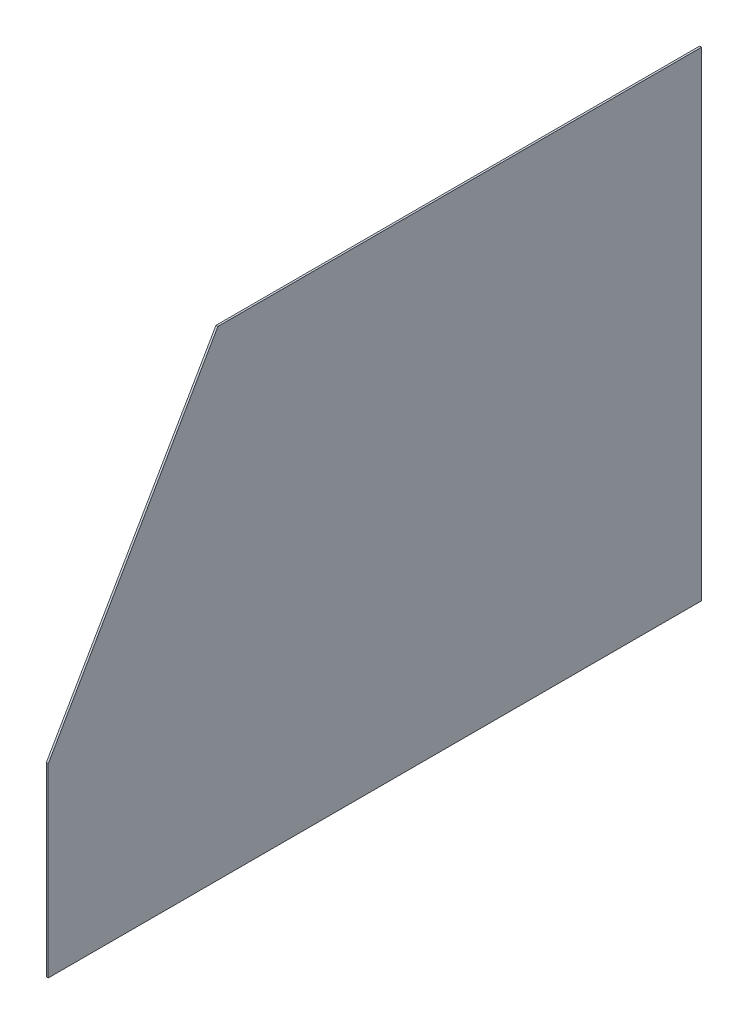
ISO-10303-21;
HEADER;
FILE_DESCRIPTION(('STEP AP214'),'2;1');
FILE_NAME('part.step','',(''),(''),'','','');
FILE_SCHEMA(('AUTOMOTIVE_DESIGN { 1 0 10303 214 1 1 1 1 }'));
ENDSEC;
DATA;
#1=APPLICATION_CONTEXT('core data for automotive mechanical design processes');
#2=APPLICATION_PROTOCOL_DEFINITION('international standard','automotive_design',2000,#1);
#3=PRODUCT_CONTEXT('',#1,'mechanical');
#4=PRODUCT('Part','Part','',(#3));
#5=PRODUCT_RELATED_PRODUCT_CATEGORY('part','',(#4));
#6=PRODUCT_DEFINITION_FORMATION('','',#4);
#7=PRODUCT_DEFINITION_CONTEXT('part definition',#1,'design');
#8=PRODUCT_DEFINITION('design','',#6,#7);
#9=PRODUCT_DEFINITION_SHAPE('','',#8);
#10=(LENGTH_UNIT() NAMED_UNIT(*) SI_UNIT(.MILLI.,.METRE.));
#11=(NAMED_UNIT(*) PLANE_ANGLE_UNIT() SI_UNIT($,.RADIAN.));
#12=(NAMED_UNIT(*) SI_UNIT($,.STERADIAN.) SOLID_ANGLE_UNIT());
#13=UNCERTAINTY_MEASURE_WITH_UNIT(LENGTH_MEASURE(1.E-05),#10,'distance_accuracy_value','');
#14=(GEOMETRIC_REPRESENTATION_CONTEXT(3) GLOBAL_UNCERTAINTY_ASSIGNED_CONTEXT((#13)) GLOBAL_UNIT_ASSIGNED_CONTEXT((#10,
#11,#12)) REPRESENTATION_CONTEXT('',''));
#15=CARTESIAN_POINT('',(0.,0.,0.));
#16=DIRECTION('',(0.,0.,1.));
#17=DIRECTION('',(1.,0.,0.));
#18=AXIS2_PLACEMENT_3D('',#15,#16,#17);
#19=CARTESIAN_POINT('',(3.175,-787.4,0.));
#20=DIRECTION('',(0.,0.,1.));
#21=DIRECTION('',(1.,0.,0.));
#22=AXIS2_PLACEMENT_3D('',#19,#20,#21);
#23=PLANE('',#22);
#24=DIRECTION('',(0.,1.,0.));
#25=VECTOR('',#24,1.);
#26=CARTESIAN_POINT('',(0.,-787.4,0.));
#27=LINE('',#26,#25);
#28=CARTESIAN_POINT('',(0.,-787.4,0.));
#29=VERTEX_POINT('',#28);
#30=CARTESIAN_POINT('',(0.,0.,0.));
#31=VERTEX_POINT('',#30);
#32=EDGE_CURVE('E106',#29,#31,#27,.T.);
#33=ORIENTED_EDGE('',*,*,#32,.T.);
#34=DIRECTION('',(-1.,0.,0.));
#35=VECTOR('',#34,1.);
#36=CARTESIAN_POINT('',(3.175,0.,0.));
#37=LINE('',#36,#35);
#38=CARTESIAN_POINT('',(3.175,0.,0.));
#39=VERTEX_POINT('',#38);
#40=EDGE_CURVE('E11',#39,#31,#37,.T.);
#41=ORIENTED_EDGE('',*,*,#40,.F.);
#42=DIRECTION('',(0.,1.,0.));
#43=VECTOR('',#42,1.);
#44=CARTESIAN_POINT('',(3.175,-787.4,0.));
#45=LINE('',#44,#43);
#46=CARTESIAN_POINT('',(3.175,-787.4,0.));
#47=VERTEX_POINT('',#46);
#48=EDGE_CURVE('E114',#47,#39,#45,.T.);
#49=ORIENTED_EDGE('',*,*,#48,.F.);
#50=DIRECTION('',(-1.,0.,0.));
#51=VECTOR('',#50,1.);
#52=CARTESIAN_POINT('',(3.175,-787.4,0.));
#53=LINE('',#52,#51);
#54=EDGE_CURVE('E102',#47,#29,#53,.T.);
#55=ORIENTED_EDGE('',*,*,#54,.T.);
#56=EDGE_LOOP('',(#33,#41,#49,#55));
#57=FACE_BOUND('',#56,.T.);
#58=ADVANCED_FACE('F32',(#57),#23,.F.);
#59=CARTESIAN_POINT('',(3.175,0.,0.));
#60=DIRECTION('',(0.,-1.,0.));
#61=DIRECTION('',(0.,0.,-1.));
#62=AXIS2_PLACEMENT_3D('',#59,#60,#61);
#63=PLANE('',#62);
#64=DIRECTION('',(0.,0.,1.));
#65=VECTOR('',#64,1.);
#66=CARTESIAN_POINT('',(0.,0.,0.));
#67=LINE('',#66,#65);
#68=CARTESIAN_POINT('',(0.,0.,794.520760089086));
#69=VERTEX_POINT('',#68);
#70=EDGE_CURVE('E109',#31,#69,#67,.T.);
#71=ORIENTED_EDGE('',*,*,#70,.T.);
#72=DIRECTION('',(-1.,0.,0.));
#73=VECTOR('',#72,1.);
#74=CARTESIAN_POINT('',(3.175,0.,794.520760089086));
#75=LINE('',#74,#73);
#76=CARTESIAN_POINT('',(3.175,0.,794.520760089086));
#77=VERTEX_POINT('',#76);
#78=EDGE_CURVE('E40',#77,#69,#75,.T.);
#79=ORIENTED_EDGE('',*,*,#78,.F.);
#80=DIRECTION('',(0.,0.,1.));
#81=VECTOR('',#80,1.);
#82=CARTESIAN_POINT('',(3.175,0.,0.));
#83=LINE('',#82,#81);
#84=EDGE_CURVE('E82',#39,#77,#83,.T.);
#85=ORIENTED_EDGE('',*,*,#84,.F.);
#86=ORIENTED_EDGE('',*,*,#40,.T.);
#87=EDGE_LOOP('',(#71,#79,#85,#86));
#88=FACE_BOUND('',#87,.T.);
#89=ADVANCED_FACE('F133',(#88),#63,.F.);
#90=CARTESIAN_POINT('',(3.175,0.,794.520760089086));
#91=DIRECTION('',(0.,-0.500000000000001,-0.866025403784438));
#92=DIRECTION('',(0.,0.866025403784438,-0.500000000000001));
#93=AXIS2_PLACEMENT_3D('',#90,#91,#92);
#94=PLANE('',#93);
#95=DIRECTION('',(0.,-0.866025403784438,0.500000000000001));
#96=VECTOR('',#95,1.);
#97=CARTESIAN_POINT('',(0.,0.,794.520760089086));
#98=LINE('',#97,#96);
#99=CARTESIAN_POINT('',(0.,-482.6,1073.15));
#100=VERTEX_POINT('',#99);
#101=EDGE_CURVE('E97',#69,#100,#98,.T.);
#102=ORIENTED_EDGE('',*,*,#101,.T.);
#103=DIRECTION('',(-1.,0.,0.));
#104=VECTOR('',#103,1.);
#105=CARTESIAN_POINT('',(3.175,-482.6,1073.15));
#106=LINE('',#105,#104);
#107=CARTESIAN_POINT('',(3.175,-482.6,1073.15));
#108=VERTEX_POINT('',#107);
#109=EDGE_CURVE('E94',#108,#100,#106,.T.);
#110=ORIENTED_EDGE('',*,*,#109,.F.);
#111=DIRECTION('',(0.,-0.866025403784438,0.500000000000001));
#112=VECTOR('',#111,1.);
#113=CARTESIAN_POINT('',(3.175,0.,794.520760089086));
#114=LINE('',#113,#112);
#115=EDGE_CURVE('E86',#77,#108,#114,.T.);
#116=ORIENTED_EDGE('',*,*,#115,.F.);
#117=ORIENTED_EDGE('',*,*,#78,.T.);
#118=EDGE_LOOP('',(#102,#110,#116,#117));
#119=FACE_BOUND('',#118,.T.);
#120=ADVANCED_FACE('F95',(#119),#94,.F.);
#121=CARTESIAN_POINT('',(3.175,-482.6,1073.15));
#122=DIRECTION('',(0.,0.,-1.));
#123=DIRECTION('',(-1.,0.,0.));
#124=AXIS2_PLACEMENT_3D('',#121,#122,#123);
#125=PLANE('',#124);
#126=DIRECTION('',(0.,-1.,0.));
#127=VECTOR('',#126,1.);
#128=CARTESIAN_POINT('',(0.,-482.6,1073.15));
#129=LINE('',#128,#127);
#130=CARTESIAN_POINT('',(0.,-787.4,1073.15));
#131=VERTEX_POINT('',#130);
#132=EDGE_CURVE('E68',#100,#131,#129,.T.);
#133=ORIENTED_EDGE('',*,*,#132,.T.);
#134=DIRECTION('',(-1.,0.,0.));
#135=VECTOR('',#134,1.);
#136=CARTESIAN_POINT('',(3.175,-787.4,1073.15));
#137=LINE('',#136,#135);
#138=CARTESIAN_POINT('',(3.175,-787.4,1073.15));
#139=VERTEX_POINT('',#138);
#140=EDGE_CURVE('E98',#139,#131,#137,.T.);
#141=ORIENTED_EDGE('',*,*,#140,.F.);
#142=DIRECTION('',(0.,-1.,0.));
#143=VECTOR('',#142,1.);
#144=CARTESIAN_POINT('',(3.175,-482.6,1073.15));
#145=LINE('',#144,#143);
#146=EDGE_CURVE('E90',#108,#139,#145,.T.);
#147=ORIENTED_EDGE('',*,*,#146,.F.);
#148=ORIENTED_EDGE('',*,*,#109,.T.);
#149=EDGE_LOOP('',(#133,#141,#147,#148));
#150=FACE_BOUND('',#149,.T.);
#151=ADVANCED_FACE('F100',(#150),#125,.F.);
#152=CARTESIAN_POINT('',(3.175,-787.4,1073.15));
#153=DIRECTION('',(0.,1.,0.));
#154=DIRECTION('',(0.,0.,1.));
#155=AXIS2_PLACEMENT_3D('',#152,#153,#154);
#156=PLANE('',#155);
#157=DIRECTION('',(0.,0.,-1.));
#158=VECTOR('',#157,1.);
#159=CARTESIAN_POINT('',(0.,-787.4,1073.15));
#160=LINE('',#159,#158);
#161=EDGE_CURVE('E74',#131,#29,#160,.T.);
#162=ORIENTED_EDGE('',*,*,#161,.T.);
#163=ORIENTED_EDGE('',*,*,#54,.F.);
#164=DIRECTION('',(0.,0.,-1.));
#165=VECTOR('',#164,1.);
#166=CARTESIAN_POINT('',(3.175,-787.4,1073.15));
#167=LINE('',#166,#165);
#168=EDGE_CURVE('E48',#139,#47,#167,.T.);
#169=ORIENTED_EDGE('',*,*,#168,.F.);
#170=ORIENTED_EDGE('',*,*,#140,.T.);
#171=EDGE_LOOP('',(#162,#163,#169,#170));
#172=FACE_BOUND('',#171,.T.);
#173=ADVANCED_FACE('F122',(#172),#156,.F.);
#174=CARTESIAN_POINT('',(3.175,0.,0.));
#175=DIRECTION('',(1.,0.,0.));
#176=DIRECTION('',(0.,0.,-1.));
#177=AXIS2_PLACEMENT_3D('',#174,#175,#176);
#178=PLANE('',#177);
#179=ORIENTED_EDGE('',*,*,#48,.T.);
#180=ORIENTED_EDGE('',*,*,#84,.T.);
#181=ORIENTED_EDGE('',*,*,#115,.T.);
#182=ORIENTED_EDGE('',*,*,#146,.T.);
#183=ORIENTED_EDGE('',*,*,#168,.T.);
#184=EDGE_LOOP('',(#179,#180,#181,#182,#183));
#185=FACE_BOUND('',#184,.T.);
#186=ADVANCED_FACE('F88',(#185),#178,.T.);
#187=CARTESIAN_POINT('',(0.,0.,0.));
#188=DIRECTION('',(1.,0.,0.));
#189=DIRECTION('',(0.,0.,-1.));
#190=AXIS2_PLACEMENT_3D('',#187,#188,#189);
#191=PLANE('',#190);
#192=ORIENTED_EDGE('',*,*,#32,.F.);
#193=ORIENTED_EDGE('',*,*,#161,.F.);
#194=ORIENTED_EDGE('',*,*,#132,.F.);
#195=ORIENTED_EDGE('',*,*,#101,.F.);
#196=ORIENTED_EDGE('',*,*,#70,.F.);
#197=EDGE_LOOP('',(#192,#193,#194,#195,#196));
#198=FACE_BOUND('',#197,.T.);
#199=ADVANCED_FACE('F118',(#198),#191,.F.);
#200=CLOSED_SHELL('',(#58,#89,#120,#151,#173,#186,#199));
#201=MANIFOLD_SOLID_BREP('B2',#200);
#202=ADVANCED_BREP_SHAPE_REPRESENTATION('',(#18,#201),#14);
#203=SHAPE_DEFINITION_REPRESENTATION(#9,#202);
ENDSEC;
END-ISO-10303-21;
